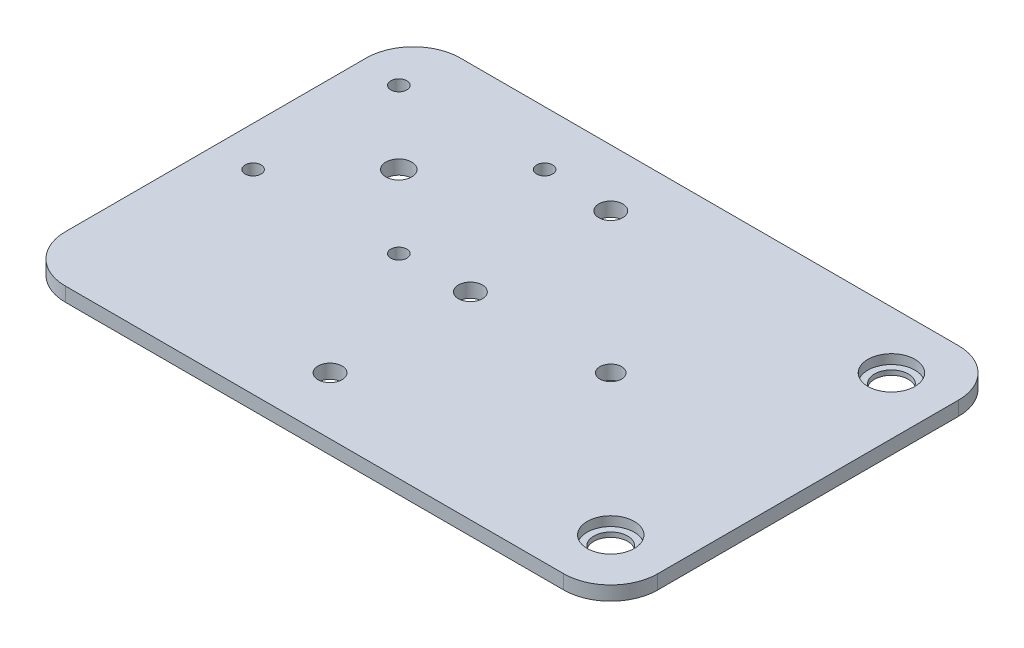
ISO-10303-21;
HEADER;
FILE_DESCRIPTION(('STEP AP214'),'2;1');
FILE_NAME('part.step','',(''),(''),'','','');
FILE_SCHEMA(('AUTOMOTIVE_DESIGN { 1 0 10303 214 1 1 1 1 }'));
ENDSEC;
DATA;
#1=APPLICATION_CONTEXT('core data for automotive mechanical design processes');
#2=APPLICATION_PROTOCOL_DEFINITION('international standard','automotive_design',2000,#1);
#3=PRODUCT_CONTEXT('',#1,'mechanical');
#4=PRODUCT('Part','Part','',(#3));
#5=PRODUCT_RELATED_PRODUCT_CATEGORY('part','',(#4));
#6=PRODUCT_DEFINITION_FORMATION('','',#4);
#7=PRODUCT_DEFINITION_CONTEXT('part definition',#1,'design');
#8=PRODUCT_DEFINITION('design','',#6,#7);
#9=PRODUCT_DEFINITION_SHAPE('','',#8);
#10=(LENGTH_UNIT() NAMED_UNIT(*) SI_UNIT(.MILLI.,.METRE.));
#11=(NAMED_UNIT(*) PLANE_ANGLE_UNIT() SI_UNIT($,.RADIAN.));
#12=(NAMED_UNIT(*) SI_UNIT($,.STERADIAN.) SOLID_ANGLE_UNIT());
#13=UNCERTAINTY_MEASURE_WITH_UNIT(LENGTH_MEASURE(1.E-05),#10,'distance_accuracy_value','');
#14=(GEOMETRIC_REPRESENTATION_CONTEXT(3) GLOBAL_UNCERTAINTY_ASSIGNED_CONTEXT((#13)) GLOBAL_UNIT_ASSIGNED_CONTEXT((#10,
#11,#12)) REPRESENTATION_CONTEXT('',''));
#15=CARTESIAN_POINT('',(0.,0.,0.));
#16=DIRECTION('',(0.,0.,1.));
#17=DIRECTION('',(1.,0.,0.));
#18=AXIS2_PLACEMENT_3D('',#15,#16,#17);
#19=CARTESIAN_POINT('',(42.,3.,-42.));
#20=DIRECTION('',(0.,0.,-1.));
#21=DIRECTION('',(-1.,0.,0.));
#22=AXIS2_PLACEMENT_3D('',#19,#20,#21);
#23=PLANE('',#22);
#24=DIRECTION('',(-1.,0.,0.));
#25=VECTOR('',#24,1.);
#26=CARTESIAN_POINT('',(-42.,3.,-42.));
#27=LINE('',#26,#25);
#28=CARTESIAN_POINT('',(32.,3.,-42.));
#29=VERTEX_POINT('',#28);
#30=CARTESIAN_POINT('',(-74.,3.,-42.));
#31=VERTEX_POINT('',#30);
#32=EDGE_CURVE('E159',#29,#31,#27,.T.);
#33=ORIENTED_EDGE('',*,*,#32,.T.);
#34=DIRECTION('',(0.,1.,0.));
#35=VECTOR('',#34,1.);
#36=CARTESIAN_POINT('',(-74.,3.,-42.));
#37=LINE('',#36,#35);
#38=CARTESIAN_POINT('',(-74.,6.,-42.));
#39=VERTEX_POINT('',#38);
#40=EDGE_CURVE('E155',#31,#39,#37,.T.);
#41=ORIENTED_EDGE('',*,*,#40,.T.);
#42=DIRECTION('',(-1.,0.,0.));
#43=VECTOR('',#42,1.);
#44=CARTESIAN_POINT('',(42.,6.,-42.));
#45=LINE('',#44,#43);
#46=CARTESIAN_POINT('',(32.,6.,-42.));
#47=VERTEX_POINT('',#46);
#48=EDGE_CURVE('E108',#47,#39,#45,.T.);
#49=ORIENTED_EDGE('',*,*,#48,.F.);
#50=DIRECTION('',(0.,1.,0.));
#51=VECTOR('',#50,1.);
#52=CARTESIAN_POINT('',(32.,3.,-42.));
#53=LINE('',#52,#51);
#54=EDGE_CURVE('E153',#47,#29,#53,.F.);
#55=ORIENTED_EDGE('',*,*,#54,.T.);
#56=EDGE_LOOP('',(#33,#41,#49,#55));
#57=FACE_BOUND('',#56,.T.);
#58=ADVANCED_FACE('F37',(#57),#23,.T.);
#59=CARTESIAN_POINT('',(42.,3.,42.));
#60=DIRECTION('',(1.,0.,0.));
#61=DIRECTION('',(0.,0.,-1.));
#62=AXIS2_PLACEMENT_3D('',#59,#60,#61);
#63=PLANE('',#62);
#64=DIRECTION('',(0.,0.,-1.));
#65=VECTOR('',#64,1.);
#66=CARTESIAN_POINT('',(42.,3.,42.));
#67=LINE('',#66,#65);
#68=CARTESIAN_POINT('',(42.,3.,32.));
#69=VERTEX_POINT('',#68);
#70=CARTESIAN_POINT('',(42.,3.,-32.));
#71=VERTEX_POINT('',#70);
#72=EDGE_CURVE('E130',#69,#71,#67,.T.);
#73=ORIENTED_EDGE('',*,*,#72,.T.);
#74=DIRECTION('',(0.,1.,0.));
#75=VECTOR('',#74,1.);
#76=CARTESIAN_POINT('',(42.,3.,-32.));
#77=LINE('',#76,#75);
#78=CARTESIAN_POINT('',(42.,6.,-32.));
#79=VERTEX_POINT('',#78);
#80=EDGE_CURVE('E11',#71,#79,#77,.T.);
#81=ORIENTED_EDGE('',*,*,#80,.T.);
#82=DIRECTION('',(0.,0.,-1.));
#83=VECTOR('',#82,1.);
#84=CARTESIAN_POINT('',(42.,6.,42.));
#85=LINE('',#84,#83);
#86=CARTESIAN_POINT('',(42.,6.,32.));
#87=VERTEX_POINT('',#86);
#88=EDGE_CURVE('E163',#87,#79,#85,.T.);
#89=ORIENTED_EDGE('',*,*,#88,.F.);
#90=DIRECTION('',(0.,1.,0.));
#91=VECTOR('',#90,1.);
#92=CARTESIAN_POINT('',(42.,3.,32.));
#93=LINE('',#92,#91);
#94=EDGE_CURVE('E45',#87,#69,#93,.F.);
#95=ORIENTED_EDGE('',*,*,#94,.T.);
#96=EDGE_LOOP('',(#73,#81,#89,#95));
#97=FACE_BOUND('',#96,.T.);
#98=ADVANCED_FACE('F171',(#97),#63,.T.);
#99=CARTESIAN_POINT('',(-42.,3.,42.));
#100=DIRECTION('',(0.,0.,1.));
#101=DIRECTION('',(1.,0.,0.));
#102=AXIS2_PLACEMENT_3D('',#99,#100,#101);
#103=PLANE('',#102);
#104=DIRECTION('',(1.,0.,0.));
#105=VECTOR('',#104,1.);
#106=CARTESIAN_POINT('',(-42.,6.,42.));
#107=LINE('',#106,#105);
#108=CARTESIAN_POINT('',(-74.,6.,42.));
#109=VERTEX_POINT('',#108);
#110=CARTESIAN_POINT('',(32.,6.,42.));
#111=VERTEX_POINT('',#110);
#112=EDGE_CURVE('E124',#109,#111,#107,.T.);
#113=ORIENTED_EDGE('',*,*,#112,.F.);
#114=DIRECTION('',(0.,1.,0.));
#115=VECTOR('',#114,1.);
#116=CARTESIAN_POINT('',(-74.,3.,42.));
#117=LINE('',#116,#115);
#118=CARTESIAN_POINT('',(-74.,3.,42.));
#119=VERTEX_POINT('',#118);
#120=EDGE_CURVE('E145',#109,#119,#117,.F.);
#121=ORIENTED_EDGE('',*,*,#120,.T.);
#122=DIRECTION('',(1.,0.,0.));
#123=VECTOR('',#122,1.);
#124=CARTESIAN_POINT('',(-42.,3.,42.));
#125=LINE('',#124,#123);
#126=CARTESIAN_POINT('',(32.,3.,42.));
#127=VERTEX_POINT('',#126);
#128=EDGE_CURVE('E134',#119,#127,#125,.T.);
#129=ORIENTED_EDGE('',*,*,#128,.T.);
#130=DIRECTION('',(0.,1.,0.));
#131=VECTOR('',#130,1.);
#132=CARTESIAN_POINT('',(32.,3.,42.));
#133=LINE('',#132,#131);
#134=EDGE_CURVE('E142',#127,#111,#133,.T.);
#135=ORIENTED_EDGE('',*,*,#134,.T.);
#136=EDGE_LOOP('',(#113,#121,#129,#135));
#137=FACE_BOUND('',#136,.T.);
#138=ADVANCED_FACE('F181',(#137),#103,.T.);
#139=CARTESIAN_POINT('',(-84.,3.,-42.));
#140=DIRECTION('',(-1.,0.,0.));
#141=DIRECTION('',(0.,0.,1.));
#142=AXIS2_PLACEMENT_3D('',#139,#140,#141);
#143=PLANE('',#142);
#144=DIRECTION('',(0.,0.,1.));
#145=VECTOR('',#144,1.);
#146=CARTESIAN_POINT('',(-84.,3.,-42.));
#147=LINE('',#146,#145);
#148=CARTESIAN_POINT('',(-84.,3.,-32.));
#149=VERTEX_POINT('',#148);
#150=CARTESIAN_POINT('',(-84.,3.,32.));
#151=VERTEX_POINT('',#150);
#152=EDGE_CURVE('E160',#149,#151,#147,.T.);
#153=ORIENTED_EDGE('',*,*,#152,.T.);
#154=DIRECTION('',(0.,1.,0.));
#155=VECTOR('',#154,1.);
#156=CARTESIAN_POINT('',(-84.,3.,32.));
#157=LINE('',#156,#155);
#158=CARTESIAN_POINT('',(-84.,6.,32.));
#159=VERTEX_POINT('',#158);
#160=EDGE_CURVE('E123',#151,#159,#157,.T.);
#161=ORIENTED_EDGE('',*,*,#160,.T.);
#162=DIRECTION('',(0.,0.,1.));
#163=VECTOR('',#162,1.);
#164=CARTESIAN_POINT('',(-84.,6.,-42.));
#165=LINE('',#164,#163);
#166=CARTESIAN_POINT('',(-84.,6.,-32.));
#167=VERTEX_POINT('',#166);
#168=EDGE_CURVE('E106',#167,#159,#165,.T.);
#169=ORIENTED_EDGE('',*,*,#168,.F.);
#170=DIRECTION('',(0.,1.,0.));
#171=VECTOR('',#170,1.);
#172=CARTESIAN_POINT('',(-84.,3.,-32.));
#173=LINE('',#172,#171);
#174=EDGE_CURVE('E120',#167,#149,#173,.F.);
#175=ORIENTED_EDGE('',*,*,#174,.T.);
#176=EDGE_LOOP('',(#153,#161,#169,#175));
#177=FACE_BOUND('',#176,.T.);
#178=ADVANCED_FACE('F119',(#177),#143,.T.);
#179=CARTESIAN_POINT('',(0.,3.,0.));
#180=DIRECTION('',(0.,1.,0.));
#181=DIRECTION('',(0.,0.,1.));
#182=AXIS2_PLACEMENT_3D('',#179,#180,#181);
#183=PLANE('',#182);
#184=CARTESIAN_POINT('',(-60.,3.,-14.925));
#185=DIRECTION('',(0.,1.,0.));
#186=DIRECTION('',(0.,0.,1.));
#187=AXIS2_PLACEMENT_3D('',#184,#185,#186);
#188=CIRCLE('',#187,2.75);
#189=CARTESIAN_POINT('',(-60.,3.,-12.175));
#190=VERTEX_POINT('',#189);
#191=EDGE_CURVE('E284',#190,#190,#188,.T.);
#192=ORIENTED_EDGE('',*,*,#191,.T.);
#193=EDGE_LOOP('',(#192));
#194=FACE_BOUND('',#193,.T.);
#195=CARTESIAN_POINT('',(-75.5,3.,-30.425));
#196=DIRECTION('',(0.,1.,0.));
#197=DIRECTION('',(0.,0.,1.));
#198=AXIS2_PLACEMENT_3D('',#195,#196,#197);
#199=CIRCLE('',#198,1.69999999999999);
#200=CARTESIAN_POINT('',(-75.5,3.,-28.725));
#201=VERTEX_POINT('',#200);
#202=EDGE_CURVE('E279',#201,#201,#199,.T.);
#203=ORIENTED_EDGE('',*,*,#202,.T.);
#204=EDGE_LOOP('',(#203));
#205=FACE_BOUND('',#204,.T.);
#206=CARTESIAN_POINT('',(-44.5,3.,-30.425));
#207=DIRECTION('',(0.,1.,0.));
#208=DIRECTION('',(0.,0.,1.));
#209=AXIS2_PLACEMENT_3D('',#206,#207,#208);
#210=CIRCLE('',#209,1.7);
#211=CARTESIAN_POINT('',(-44.5,3.,-28.725));
#212=VERTEX_POINT('',#211);
#213=EDGE_CURVE('E294',#212,#212,#210,.T.);
#214=ORIENTED_EDGE('',*,*,#213,.T.);
#215=EDGE_LOOP('',(#214));
#216=FACE_BOUND('',#215,.T.);
#217=CARTESIAN_POINT('',(-44.5,3.,0.574999999999987));
#218=DIRECTION('',(0.,1.,0.));
#219=DIRECTION('',(0.,0.,1.));
#220=AXIS2_PLACEMENT_3D('',#217,#218,#219);
#221=CIRCLE('',#220,1.7);
#222=CARTESIAN_POINT('',(-44.5,3.,2.27499999999999));
#223=VERTEX_POINT('',#222);
#224=EDGE_CURVE('E300',#223,#223,#221,.T.);
#225=ORIENTED_EDGE('',*,*,#224,.T.);
#226=EDGE_LOOP('',(#225));
#227=FACE_BOUND('',#226,.T.);
#228=CARTESIAN_POINT('',(-75.5,3.,0.574999999999987));
#229=DIRECTION('',(0.,1.,0.));
#230=DIRECTION('',(0.,0.,1.));
#231=AXIS2_PLACEMENT_3D('',#228,#229,#230);
#232=CIRCLE('',#231,1.69999999999999);
#233=CARTESIAN_POINT('',(-75.5,3.,2.27499999999998));
#234=VERTEX_POINT('',#233);
#235=EDGE_CURVE('E306',#234,#234,#232,.T.);
#236=ORIENTED_EDGE('',*,*,#235,.T.);
#237=EDGE_LOOP('',(#236));
#238=FACE_BOUND('',#237,.T.);
#239=CARTESIAN_POINT('',(-29.85,3.,29.85));
#240=DIRECTION('',(0.,1.,0.));
#241=DIRECTION('',(0.,0.,1.));
#242=AXIS2_PLACEMENT_3D('',#239,#240,#241);
#243=CIRCLE('',#242,2.55);
#244=CARTESIAN_POINT('',(-29.85,3.,32.4));
#245=VERTEX_POINT('',#244);
#246=EDGE_CURVE('E312',#245,#245,#243,.T.);
#247=ORIENTED_EDGE('',*,*,#246,.T.);
#248=EDGE_LOOP('',(#247));
#249=FACE_BOUND('',#248,.T.);
#250=CARTESIAN_POINT('',(-29.85,3.,-29.85));
#251=DIRECTION('',(0.,1.,0.));
#252=DIRECTION('',(0.,0.,1.));
#253=AXIS2_PLACEMENT_3D('',#250,#251,#252);
#254=CIRCLE('',#253,2.55);
#255=CARTESIAN_POINT('',(-29.85,3.,-27.3));
#256=VERTEX_POINT('',#255);
#257=EDGE_CURVE('E318',#256,#256,#254,.T.);
#258=ORIENTED_EDGE('',*,*,#257,.T.);
#259=EDGE_LOOP('',(#258));
#260=FACE_BOUND('',#259,.T.);
#261=CARTESIAN_POINT('',(-29.85,3.,0.));
#262=DIRECTION('',(0.,1.,0.));
#263=DIRECTION('',(0.,0.,1.));
#264=AXIS2_PLACEMENT_3D('',#261,#262,#263);
#265=CIRCLE('',#264,2.55);
#266=CARTESIAN_POINT('',(-29.85,3.,2.55));
#267=VERTEX_POINT('',#266);
#268=EDGE_CURVE('E324',#267,#267,#265,.T.);
#269=ORIENTED_EDGE('',*,*,#268,.T.);
#270=EDGE_LOOP('',(#269));
#271=FACE_BOUND('',#270,.T.);
#272=CARTESIAN_POINT('',(29.85,3.,-29.85));
#273=DIRECTION('',(0.,1.,0.));
#274=DIRECTION('',(0.,0.,1.));
#275=AXIS2_PLACEMENT_3D('',#272,#273,#274);
#276=CIRCLE('',#275,3.6);
#277=CARTESIAN_POINT('',(29.85,3.,-26.25));
#278=VERTEX_POINT('',#277);
#279=EDGE_CURVE('E336',#278,#278,#276,.T.);
#280=ORIENTED_EDGE('',*,*,#279,.T.);
#281=EDGE_LOOP('',(#280));
#282=FACE_BOUND('',#281,.T.);
#283=CARTESIAN_POINT('',(29.85,3.,29.85));
#284=DIRECTION('',(0.,1.,0.));
#285=DIRECTION('',(0.,0.,1.));
#286=AXIS2_PLACEMENT_3D('',#283,#284,#285);
#287=CIRCLE('',#286,3.6);
#288=CARTESIAN_POINT('',(29.85,3.,33.45));
#289=VERTEX_POINT('',#288);
#290=EDGE_CURVE('E348',#289,#289,#287,.T.);
#291=ORIENTED_EDGE('',*,*,#290,.T.);
#292=EDGE_LOOP('',(#291));
#293=FACE_BOUND('',#292,.T.);
#294=CARTESIAN_POINT('',(0.,3.,0.));
#295=DIRECTION('',(0.,-1.,0.));
#296=DIRECTION('',(0.,0.,-1.));
#297=AXIS2_PLACEMENT_3D('',#294,#295,#296);
#298=CIRCLE('',#297,2.3);
#299=CARTESIAN_POINT('',(0.,3.,-2.3));
#300=VERTEX_POINT('',#299);
#301=EDGE_CURVE('E350',#300,#300,#298,.T.);
#302=ORIENTED_EDGE('',*,*,#301,.F.);
#303=EDGE_LOOP('',(#302));
#304=FACE_BOUND('',#303,.T.);
#305=ORIENTED_EDGE('',*,*,#128,.F.);
#306=CARTESIAN_POINT('',(-74.,3.,32.));
#307=DIRECTION('',(0.,1.,0.));
#308=DIRECTION('',(0.,0.,1.));
#309=AXIS2_PLACEMENT_3D('',#306,#307,#308);
#310=CIRCLE('',#309,10.);
#311=EDGE_CURVE('E151',#119,#151,#310,.F.);
#312=ORIENTED_EDGE('',*,*,#311,.T.);
#313=ORIENTED_EDGE('',*,*,#152,.F.);
#314=CARTESIAN_POINT('',(-74.,3.,-32.));
#315=DIRECTION('',(0.,1.,0.));
#316=DIRECTION('',(0.,0.,1.));
#317=AXIS2_PLACEMENT_3D('',#314,#315,#316);
#318=CIRCLE('',#317,10.);
#319=EDGE_CURVE('E129',#149,#31,#318,.F.);
#320=ORIENTED_EDGE('',*,*,#319,.T.);
#321=ORIENTED_EDGE('',*,*,#32,.F.);
#322=CARTESIAN_POINT('',(32.,3.,-32.));
#323=DIRECTION('',(0.,1.,0.));
#324=DIRECTION('',(0.,0.,1.));
#325=AXIS2_PLACEMENT_3D('',#322,#323,#324);
#326=CIRCLE('',#325,10.);
#327=EDGE_CURVE('E52',#29,#71,#326,.F.);
#328=ORIENTED_EDGE('',*,*,#327,.T.);
#329=ORIENTED_EDGE('',*,*,#72,.F.);
#330=CARTESIAN_POINT('',(32.,3.,32.));
#331=DIRECTION('',(0.,1.,0.));
#332=DIRECTION('',(0.,0.,1.));
#333=AXIS2_PLACEMENT_3D('',#330,#331,#332);
#334=CIRCLE('',#333,10.);
#335=EDGE_CURVE('E147',#69,#127,#334,.F.);
#336=ORIENTED_EDGE('',*,*,#335,.T.);
#337=EDGE_LOOP('',(#305,#312,#313,#320,#321,#328,#329,#336));
#338=FACE_BOUND('',#337,.T.);
#339=ADVANCED_FACE('F177',(#194,#205,#216,#227,#238,#249,#260,#271,#282,#293,#304,#338),#183,.F.);
#340=CARTESIAN_POINT('',(0.,6.,0.));
#341=DIRECTION('',(0.,1.,0.));
#342=DIRECTION('',(0.,0.,1.));
#343=AXIS2_PLACEMENT_3D('',#340,#341,#342);
#344=PLANE('',#343);
#345=CARTESIAN_POINT('',(-60.,6.,-14.925));
#346=DIRECTION('',(0.,1.,0.));
#347=DIRECTION('',(0.,0.,1.));
#348=AXIS2_PLACEMENT_3D('',#345,#346,#347);
#349=CIRCLE('',#348,2.75);
#350=CARTESIAN_POINT('',(-60.,6.,-12.175));
#351=VERTEX_POINT('',#350);
#352=EDGE_CURVE('E288',#351,#351,#349,.T.);
#353=ORIENTED_EDGE('',*,*,#352,.F.);
#354=EDGE_LOOP('',(#353));
#355=FACE_BOUND('',#354,.T.);
#356=CARTESIAN_POINT('',(-75.5,6.,-30.425));
#357=DIRECTION('',(0.,1.,0.));
#358=DIRECTION('',(0.,0.,1.));
#359=AXIS2_PLACEMENT_3D('',#356,#357,#358);
#360=CIRCLE('',#359,1.69999999999999);
#361=CARTESIAN_POINT('',(-75.5,6.,-28.725));
#362=VERTEX_POINT('',#361);
#363=EDGE_CURVE('E282',#362,#362,#360,.T.);
#364=ORIENTED_EDGE('',*,*,#363,.F.);
#365=EDGE_LOOP('',(#364));
#366=FACE_BOUND('',#365,.T.);
#367=CARTESIAN_POINT('',(-44.5,6.,-30.425));
#368=DIRECTION('',(0.,1.,0.));
#369=DIRECTION('',(0.,0.,1.));
#370=AXIS2_PLACEMENT_3D('',#367,#368,#369);
#371=CIRCLE('',#370,1.7);
#372=CARTESIAN_POINT('',(-44.5,6.,-28.725));
#373=VERTEX_POINT('',#372);
#374=EDGE_CURVE('E286',#373,#373,#371,.T.);
#375=ORIENTED_EDGE('',*,*,#374,.F.);
#376=EDGE_LOOP('',(#375));
#377=FACE_BOUND('',#376,.T.);
#378=CARTESIAN_POINT('',(-44.5,6.,0.574999999999987));
#379=DIRECTION('',(0.,1.,0.));
#380=DIRECTION('',(0.,0.,1.));
#381=AXIS2_PLACEMENT_3D('',#378,#379,#380);
#382=CIRCLE('',#381,1.7);
#383=CARTESIAN_POINT('',(-44.5,6.,2.27499999999999));
#384=VERTEX_POINT('',#383);
#385=EDGE_CURVE('E297',#384,#384,#382,.T.);
#386=ORIENTED_EDGE('',*,*,#385,.F.);
#387=EDGE_LOOP('',(#386));
#388=FACE_BOUND('',#387,.T.);
#389=CARTESIAN_POINT('',(-75.5,6.,0.574999999999987));
#390=DIRECTION('',(0.,1.,0.));
#391=DIRECTION('',(0.,0.,1.));
#392=AXIS2_PLACEMENT_3D('',#389,#390,#391);
#393=CIRCLE('',#392,1.69999999999999);
#394=CARTESIAN_POINT('',(-75.5,6.,2.27499999999998));
#395=VERTEX_POINT('',#394);
#396=EDGE_CURVE('E303',#395,#395,#393,.T.);
#397=ORIENTED_EDGE('',*,*,#396,.F.);
#398=EDGE_LOOP('',(#397));
#399=FACE_BOUND('',#398,.T.);
#400=CARTESIAN_POINT('',(-29.85,6.,29.85));
#401=DIRECTION('',(0.,1.,0.));
#402=DIRECTION('',(0.,0.,1.));
#403=AXIS2_PLACEMENT_3D('',#400,#401,#402);
#404=CIRCLE('',#403,2.55);
#405=CARTESIAN_POINT('',(-29.85,6.,32.4));
#406=VERTEX_POINT('',#405);
#407=EDGE_CURVE('E309',#406,#406,#404,.T.);
#408=ORIENTED_EDGE('',*,*,#407,.F.);
#409=EDGE_LOOP('',(#408));
#410=FACE_BOUND('',#409,.T.);
#411=CARTESIAN_POINT('',(-29.85,6.,-29.85));
#412=DIRECTION('',(0.,1.,0.));
#413=DIRECTION('',(0.,0.,1.));
#414=AXIS2_PLACEMENT_3D('',#411,#412,#413);
#415=CIRCLE('',#414,2.55);
#416=CARTESIAN_POINT('',(-29.85,6.,-27.3));
#417=VERTEX_POINT('',#416);
#418=EDGE_CURVE('E315',#417,#417,#415,.T.);
#419=ORIENTED_EDGE('',*,*,#418,.F.);
#420=EDGE_LOOP('',(#419));
#421=FACE_BOUND('',#420,.T.);
#422=CARTESIAN_POINT('',(-29.85,6.,0.));
#423=DIRECTION('',(0.,1.,0.));
#424=DIRECTION('',(0.,0.,1.));
#425=AXIS2_PLACEMENT_3D('',#422,#423,#424);
#426=CIRCLE('',#425,2.55);
#427=CARTESIAN_POINT('',(-29.85,6.,2.55));
#428=VERTEX_POINT('',#427);
#429=EDGE_CURVE('E321',#428,#428,#426,.T.);
#430=ORIENTED_EDGE('',*,*,#429,.F.);
#431=EDGE_LOOP('',(#430));
#432=FACE_BOUND('',#431,.T.);
#433=CARTESIAN_POINT('',(29.85,6.,-29.85));
#434=DIRECTION('',(0.,1.,0.));
#435=DIRECTION('',(0.,0.,1.));
#436=AXIS2_PLACEMENT_3D('',#433,#434,#435);
#437=CIRCLE('',#436,5.);
#438=CARTESIAN_POINT('',(29.85,6.,-24.85));
#439=VERTEX_POINT('',#438);
#440=EDGE_CURVE('E327',#439,#439,#437,.T.);
#441=ORIENTED_EDGE('',*,*,#440,.F.);
#442=EDGE_LOOP('',(#441));
#443=FACE_BOUND('',#442,.T.);
#444=CARTESIAN_POINT('',(29.85,6.,29.85));
#445=DIRECTION('',(0.,1.,0.));
#446=DIRECTION('',(0.,0.,1.));
#447=AXIS2_PLACEMENT_3D('',#444,#445,#446);
#448=CIRCLE('',#447,5.);
#449=CARTESIAN_POINT('',(29.85,6.,34.85));
#450=VERTEX_POINT('',#449);
#451=EDGE_CURVE('E339',#450,#450,#448,.T.);
#452=ORIENTED_EDGE('',*,*,#451,.F.);
#453=EDGE_LOOP('',(#452));
#454=FACE_BOUND('',#453,.T.);
#455=CARTESIAN_POINT('',(0.,6.,0.));
#456=DIRECTION('',(0.,-1.,0.));
#457=DIRECTION('',(0.,0.,-1.));
#458=AXIS2_PLACEMENT_3D('',#455,#456,#457);
#459=CIRCLE('',#458,2.3);
#460=CARTESIAN_POINT('',(0.,6.,-2.3));
#461=VERTEX_POINT('',#460);
#462=EDGE_CURVE('E125',#461,#461,#459,.T.);
#463=ORIENTED_EDGE('',*,*,#462,.T.);
#464=EDGE_LOOP('',(#463));
#465=FACE_BOUND('',#464,.T.);
#466=ORIENTED_EDGE('',*,*,#168,.T.);
#467=CARTESIAN_POINT('',(-74.,6.,32.));
#468=DIRECTION('',(0.,1.,0.));
#469=DIRECTION('',(0.,0.,1.));
#470=AXIS2_PLACEMENT_3D('',#467,#468,#469);
#471=CIRCLE('',#470,10.);
#472=EDGE_CURVE('E113',#159,#109,#471,.T.);
#473=ORIENTED_EDGE('',*,*,#472,.T.);
#474=ORIENTED_EDGE('',*,*,#112,.T.);
#475=CARTESIAN_POINT('',(32.,6.,32.));
#476=DIRECTION('',(0.,1.,0.));
#477=DIRECTION('',(0.,0.,1.));
#478=AXIS2_PLACEMENT_3D('',#475,#476,#477);
#479=CIRCLE('',#478,10.);
#480=EDGE_CURVE('E132',#111,#87,#479,.T.);
#481=ORIENTED_EDGE('',*,*,#480,.T.);
#482=ORIENTED_EDGE('',*,*,#88,.T.);
#483=CARTESIAN_POINT('',(32.,6.,-32.));
#484=DIRECTION('',(0.,1.,0.));
#485=DIRECTION('',(0.,0.,1.));
#486=AXIS2_PLACEMENT_3D('',#483,#484,#485);
#487=CIRCLE('',#486,10.);
#488=EDGE_CURVE('E114',#79,#47,#487,.T.);
#489=ORIENTED_EDGE('',*,*,#488,.T.);
#490=ORIENTED_EDGE('',*,*,#48,.T.);
#491=CARTESIAN_POINT('',(-74.,6.,-32.));
#492=DIRECTION('',(0.,1.,0.));
#493=DIRECTION('',(0.,0.,1.));
#494=AXIS2_PLACEMENT_3D('',#491,#492,#493);
#495=CIRCLE('',#494,10.);
#496=EDGE_CURVE('E103',#39,#167,#495,.T.);
#497=ORIENTED_EDGE('',*,*,#496,.T.);
#498=EDGE_LOOP('',(#466,#473,#474,#481,#482,#489,#490,#497));
#499=FACE_BOUND('',#498,.T.);
#500=ADVANCED_FACE('F105',(#355,#366,#377,#388,#399,#410,#421,#432,#443,#454,#465,#499),#344,.T.);
#501=CARTESIAN_POINT('',(0.,3.,0.));
#502=DIRECTION('',(0.,-1.,0.));
#503=DIRECTION('',(0.,0.,-1.));
#504=AXIS2_PLACEMENT_3D('',#501,#502,#503);
#505=CYLINDRICAL_SURFACE('',#504,2.3);
#506=ORIENTED_EDGE('',*,*,#462,.F.);
#507=EDGE_LOOP('',(#506));
#508=FACE_BOUND('',#507,.T.);
#509=ORIENTED_EDGE('',*,*,#301,.T.);
#510=EDGE_LOOP('',(#509));
#511=FACE_BOUND('',#510,.T.);
#512=ADVANCED_FACE('F216',(#508,#511),#505,.F.);
#513=CARTESIAN_POINT('',(29.85,6.,29.85));
#514=DIRECTION('',(0.,1.,0.));
#515=DIRECTION('',(0.,0.,1.));
#516=AXIS2_PLACEMENT_3D('',#513,#514,#515);
#517=CYLINDRICAL_SURFACE('',#516,3.6);
#518=ORIENTED_EDGE('',*,*,#290,.F.);
#519=EDGE_LOOP('',(#518));
#520=FACE_BOUND('',#519,.T.);
#521=CARTESIAN_POINT('',(29.85,4.,29.85));
#522=DIRECTION('',(0.,1.,0.));
#523=DIRECTION('',(0.,0.,1.));
#524=AXIS2_PLACEMENT_3D('',#521,#522,#523);
#525=CIRCLE('',#524,3.6);
#526=CARTESIAN_POINT('',(29.85,4.,33.45));
#527=VERTEX_POINT('',#526);
#528=EDGE_CURVE('E345',#527,#527,#525,.T.);
#529=ORIENTED_EDGE('',*,*,#528,.T.);
#530=EDGE_LOOP('',(#529));
#531=FACE_BOUND('',#530,.T.);
#532=ADVANCED_FACE('F223',(#520,#531),#517,.F.);
#533=CARTESIAN_POINT('',(33.45,4.,29.85));
#534=DIRECTION('',(0.,-1.,0.));
#535=DIRECTION('',(0.,0.,-1.));
#536=AXIS2_PLACEMENT_3D('',#533,#534,#535);
#537=PLANE('',#536);
#538=ORIENTED_EDGE('',*,*,#528,.F.);
#539=EDGE_LOOP('',(#538));
#540=FACE_BOUND('',#539,.T.);
#541=CARTESIAN_POINT('',(29.85,4.,29.85));
#542=DIRECTION('',(0.,1.,0.));
#543=DIRECTION('',(0.,0.,1.));
#544=AXIS2_PLACEMENT_3D('',#541,#542,#543);
#545=CIRCLE('',#544,5.);
#546=CARTESIAN_POINT('',(29.85,4.,34.85));
#547=VERTEX_POINT('',#546);
#548=EDGE_CURVE('E342',#547,#547,#545,.T.);
#549=ORIENTED_EDGE('',*,*,#548,.T.);
#550=EDGE_LOOP('',(#549));
#551=FACE_BOUND('',#550,.T.);
#552=ADVANCED_FACE('F227',(#540,#551),#537,.F.);
#553=CARTESIAN_POINT('',(29.85,6.,29.85));
#554=DIRECTION('',(0.,1.,0.));
#555=DIRECTION('',(0.,0.,1.));
#556=AXIS2_PLACEMENT_3D('',#553,#554,#555);
#557=CYLINDRICAL_SURFACE('',#556,5.);
#558=ORIENTED_EDGE('',*,*,#548,.F.);
#559=EDGE_LOOP('',(#558));
#560=FACE_BOUND('',#559,.T.);
#561=ORIENTED_EDGE('',*,*,#451,.T.);
#562=EDGE_LOOP('',(#561));
#563=FACE_BOUND('',#562,.T.);
#564=ADVANCED_FACE('F231',(#560,#563),#557,.F.);
#565=CARTESIAN_POINT('',(29.85,6.,-29.85));
#566=DIRECTION('',(0.,1.,0.));
#567=DIRECTION('',(0.,0.,1.));
#568=AXIS2_PLACEMENT_3D('',#565,#566,#567);
#569=CYLINDRICAL_SURFACE('',#568,3.6);
#570=ORIENTED_EDGE('',*,*,#279,.F.);
#571=EDGE_LOOP('',(#570));
#572=FACE_BOUND('',#571,.T.);
#573=CARTESIAN_POINT('',(29.85,4.,-29.85));
#574=DIRECTION('',(0.,1.,0.));
#575=DIRECTION('',(0.,0.,1.));
#576=AXIS2_PLACEMENT_3D('',#573,#574,#575);
#577=CIRCLE('',#576,3.6);
#578=CARTESIAN_POINT('',(29.85,4.,-26.25));
#579=VERTEX_POINT('',#578);
#580=EDGE_CURVE('E333',#579,#579,#577,.T.);
#581=ORIENTED_EDGE('',*,*,#580,.T.);
#582=EDGE_LOOP('',(#581));
#583=FACE_BOUND('',#582,.T.);
#584=ADVANCED_FACE('F235',(#572,#583),#569,.F.);
#585=CARTESIAN_POINT('',(33.45,4.,-29.85));
#586=DIRECTION('',(0.,-1.,0.));
#587=DIRECTION('',(0.,0.,-1.));
#588=AXIS2_PLACEMENT_3D('',#585,#586,#587);
#589=PLANE('',#588);
#590=ORIENTED_EDGE('',*,*,#580,.F.);
#591=EDGE_LOOP('',(#590));
#592=FACE_BOUND('',#591,.T.);
#593=CARTESIAN_POINT('',(29.85,4.,-29.85));
#594=DIRECTION('',(0.,1.,0.));
#595=DIRECTION('',(0.,0.,1.));
#596=AXIS2_PLACEMENT_3D('',#593,#594,#595);
#597=CIRCLE('',#596,5.);
#598=CARTESIAN_POINT('',(29.85,4.,-24.85));
#599=VERTEX_POINT('',#598);
#600=EDGE_CURVE('E330',#599,#599,#597,.T.);
#601=ORIENTED_EDGE('',*,*,#600,.T.);
#602=EDGE_LOOP('',(#601));
#603=FACE_BOUND('',#602,.T.);
#604=ADVANCED_FACE('F239',(#592,#603),#589,.F.);
#605=CARTESIAN_POINT('',(29.85,6.,-29.85));
#606=DIRECTION('',(0.,1.,0.));
#607=DIRECTION('',(0.,0.,1.));
#608=AXIS2_PLACEMENT_3D('',#605,#606,#607);
#609=CYLINDRICAL_SURFACE('',#608,5.);
#610=ORIENTED_EDGE('',*,*,#600,.F.);
#611=EDGE_LOOP('',(#610));
#612=FACE_BOUND('',#611,.T.);
#613=ORIENTED_EDGE('',*,*,#440,.T.);
#614=EDGE_LOOP('',(#613));
#615=FACE_BOUND('',#614,.T.);
#616=ADVANCED_FACE('F243',(#612,#615),#609,.F.);
#617=CARTESIAN_POINT('',(-29.85,6.,0.));
#618=DIRECTION('',(0.,1.,0.));
#619=DIRECTION('',(0.,0.,1.));
#620=AXIS2_PLACEMENT_3D('',#617,#618,#619);
#621=CYLINDRICAL_SURFACE('',#620,2.55);
#622=ORIENTED_EDGE('',*,*,#268,.F.);
#623=EDGE_LOOP('',(#622));
#624=FACE_BOUND('',#623,.T.);
#625=ORIENTED_EDGE('',*,*,#429,.T.);
#626=EDGE_LOOP('',(#625));
#627=FACE_BOUND('',#626,.T.);
#628=ADVANCED_FACE('F247',(#624,#627),#621,.F.);
#629=CARTESIAN_POINT('',(-29.85,6.,-29.85));
#630=DIRECTION('',(0.,1.,0.));
#631=DIRECTION('',(0.,0.,1.));
#632=AXIS2_PLACEMENT_3D('',#629,#630,#631);
#633=CYLINDRICAL_SURFACE('',#632,2.55);
#634=ORIENTED_EDGE('',*,*,#257,.F.);
#635=EDGE_LOOP('',(#634));
#636=FACE_BOUND('',#635,.T.);
#637=ORIENTED_EDGE('',*,*,#418,.T.);
#638=EDGE_LOOP('',(#637));
#639=FACE_BOUND('',#638,.T.);
#640=ADVANCED_FACE('F251',(#636,#639),#633,.F.);
#641=CARTESIAN_POINT('',(-29.85,6.,29.85));
#642=DIRECTION('',(0.,1.,0.));
#643=DIRECTION('',(0.,0.,1.));
#644=AXIS2_PLACEMENT_3D('',#641,#642,#643);
#645=CYLINDRICAL_SURFACE('',#644,2.55);
#646=ORIENTED_EDGE('',*,*,#246,.F.);
#647=EDGE_LOOP('',(#646));
#648=FACE_BOUND('',#647,.T.);
#649=ORIENTED_EDGE('',*,*,#407,.T.);
#650=EDGE_LOOP('',(#649));
#651=FACE_BOUND('',#650,.T.);
#652=ADVANCED_FACE('F255',(#648,#651),#645,.F.);
#653=CARTESIAN_POINT('',(-75.5,6.,0.574999999999987));
#654=DIRECTION('',(0.,1.,0.));
#655=DIRECTION('',(0.,0.,1.));
#656=AXIS2_PLACEMENT_3D('',#653,#654,#655);
#657=CYLINDRICAL_SURFACE('',#656,1.69999999999999);
#658=ORIENTED_EDGE('',*,*,#235,.F.);
#659=EDGE_LOOP('',(#658));
#660=FACE_BOUND('',#659,.T.);
#661=ORIENTED_EDGE('',*,*,#396,.T.);
#662=EDGE_LOOP('',(#661));
#663=FACE_BOUND('',#662,.T.);
#664=ADVANCED_FACE('F259',(#660,#663),#657,.F.);
#665=CARTESIAN_POINT('',(-44.5,6.,0.574999999999987));
#666=DIRECTION('',(0.,1.,0.));
#667=DIRECTION('',(0.,0.,1.));
#668=AXIS2_PLACEMENT_3D('',#665,#666,#667);
#669=CYLINDRICAL_SURFACE('',#668,1.7);
#670=ORIENTED_EDGE('',*,*,#224,.F.);
#671=EDGE_LOOP('',(#670));
#672=FACE_BOUND('',#671,.T.);
#673=ORIENTED_EDGE('',*,*,#385,.T.);
#674=EDGE_LOOP('',(#673));
#675=FACE_BOUND('',#674,.T.);
#676=ADVANCED_FACE('F263',(#672,#675),#669,.F.);
#677=CARTESIAN_POINT('',(-44.5,6.,-30.425));
#678=DIRECTION('',(0.,1.,0.));
#679=DIRECTION('',(0.,0.,1.));
#680=AXIS2_PLACEMENT_3D('',#677,#678,#679);
#681=CYLINDRICAL_SURFACE('',#680,1.7);
#682=ORIENTED_EDGE('',*,*,#213,.F.);
#683=EDGE_LOOP('',(#682));
#684=FACE_BOUND('',#683,.T.);
#685=ORIENTED_EDGE('',*,*,#374,.T.);
#686=EDGE_LOOP('',(#685));
#687=FACE_BOUND('',#686,.T.);
#688=ADVANCED_FACE('F267',(#684,#687),#681,.F.);
#689=CARTESIAN_POINT('',(-75.5,6.,-30.425));
#690=DIRECTION('',(0.,1.,0.));
#691=DIRECTION('',(0.,0.,1.));
#692=AXIS2_PLACEMENT_3D('',#689,#690,#691);
#693=CYLINDRICAL_SURFACE('',#692,1.69999999999999);
#694=ORIENTED_EDGE('',*,*,#202,.F.);
#695=EDGE_LOOP('',(#694));
#696=FACE_BOUND('',#695,.T.);
#697=ORIENTED_EDGE('',*,*,#363,.T.);
#698=EDGE_LOOP('',(#697));
#699=FACE_BOUND('',#698,.T.);
#700=ADVANCED_FACE('F194',(#696,#699),#693,.F.);
#701=CARTESIAN_POINT('',(-60.,6.,-14.925));
#702=DIRECTION('',(0.,1.,0.));
#703=DIRECTION('',(0.,0.,1.));
#704=AXIS2_PLACEMENT_3D('',#701,#702,#703);
#705=CYLINDRICAL_SURFACE('',#704,2.75);
#706=ORIENTED_EDGE('',*,*,#191,.F.);
#707=EDGE_LOOP('',(#706));
#708=FACE_BOUND('',#707,.T.);
#709=ORIENTED_EDGE('',*,*,#352,.T.);
#710=EDGE_LOOP('',(#709));
#711=FACE_BOUND('',#710,.T.);
#712=ADVANCED_FACE('F186',(#708,#711),#705,.F.);
#713=CARTESIAN_POINT('',(-74.,3.,32.));
#714=DIRECTION('',(0.,1.,0.));
#715=DIRECTION('',(0.,0.,1.));
#716=AXIS2_PLACEMENT_3D('',#713,#714,#715);
#717=CYLINDRICAL_SURFACE('',#716,10.);
#718=ORIENTED_EDGE('',*,*,#311,.F.);
#719=ORIENTED_EDGE('',*,*,#120,.F.);
#720=ORIENTED_EDGE('',*,*,#472,.F.);
#721=ORIENTED_EDGE('',*,*,#160,.F.);
#722=EDGE_LOOP('',(#718,#719,#720,#721));
#723=FACE_BOUND('',#722,.T.);
#724=ADVANCED_FACE('F184',(#723),#717,.T.);
#725=CARTESIAN_POINT('',(-74.,3.,-32.));
#726=DIRECTION('',(0.,1.,0.));
#727=DIRECTION('',(0.,0.,1.));
#728=AXIS2_PLACEMENT_3D('',#725,#726,#727);
#729=CYLINDRICAL_SURFACE('',#728,10.);
#730=ORIENTED_EDGE('',*,*,#319,.F.);
#731=ORIENTED_EDGE('',*,*,#174,.F.);
#732=ORIENTED_EDGE('',*,*,#496,.F.);
#733=ORIENTED_EDGE('',*,*,#40,.F.);
#734=EDGE_LOOP('',(#730,#731,#732,#733));
#735=FACE_BOUND('',#734,.T.);
#736=ADVANCED_FACE('F128',(#735),#729,.T.);
#737=CARTESIAN_POINT('',(32.,3.,-32.));
#738=DIRECTION('',(0.,1.,0.));
#739=DIRECTION('',(0.,0.,1.));
#740=AXIS2_PLACEMENT_3D('',#737,#738,#739);
#741=CYLINDRICAL_SURFACE('',#740,10.);
#742=ORIENTED_EDGE('',*,*,#327,.F.);
#743=ORIENTED_EDGE('',*,*,#54,.F.);
#744=ORIENTED_EDGE('',*,*,#488,.F.);
#745=ORIENTED_EDGE('',*,*,#80,.F.);
#746=EDGE_LOOP('',(#742,#743,#744,#745));
#747=FACE_BOUND('',#746,.T.);
#748=ADVANCED_FACE('F192',(#747),#741,.T.);
#749=CARTESIAN_POINT('',(32.,3.,32.));
#750=DIRECTION('',(0.,1.,0.));
#751=DIRECTION('',(0.,0.,1.));
#752=AXIS2_PLACEMENT_3D('',#749,#750,#751);
#753=CYLINDRICAL_SURFACE('',#752,10.);
#754=ORIENTED_EDGE('',*,*,#335,.F.);
#755=ORIENTED_EDGE('',*,*,#94,.F.);
#756=ORIENTED_EDGE('',*,*,#480,.F.);
#757=ORIENTED_EDGE('',*,*,#134,.F.);
#758=EDGE_LOOP('',(#754,#755,#756,#757));
#759=FACE_BOUND('',#758,.T.);
#760=ADVANCED_FACE('F39',(#759),#753,.T.);
#761=CLOSED_SHELL('',(#58,#98,#138,#178,#339,#500,#512,#532,#552,#564,#584,#604,#616,#628,#640,
#652,#664,#676,#688,#700,#712,#724,#736,#748,#760));
#762=MANIFOLD_SOLID_BREP('B2',#761);
#763=ADVANCED_BREP_SHAPE_REPRESENTATION('',(#18,#762),#14);
#764=SHAPE_DEFINITION_REPRESENTATION(#9,#763);
ENDSEC;
END-ISO-10303-21;
